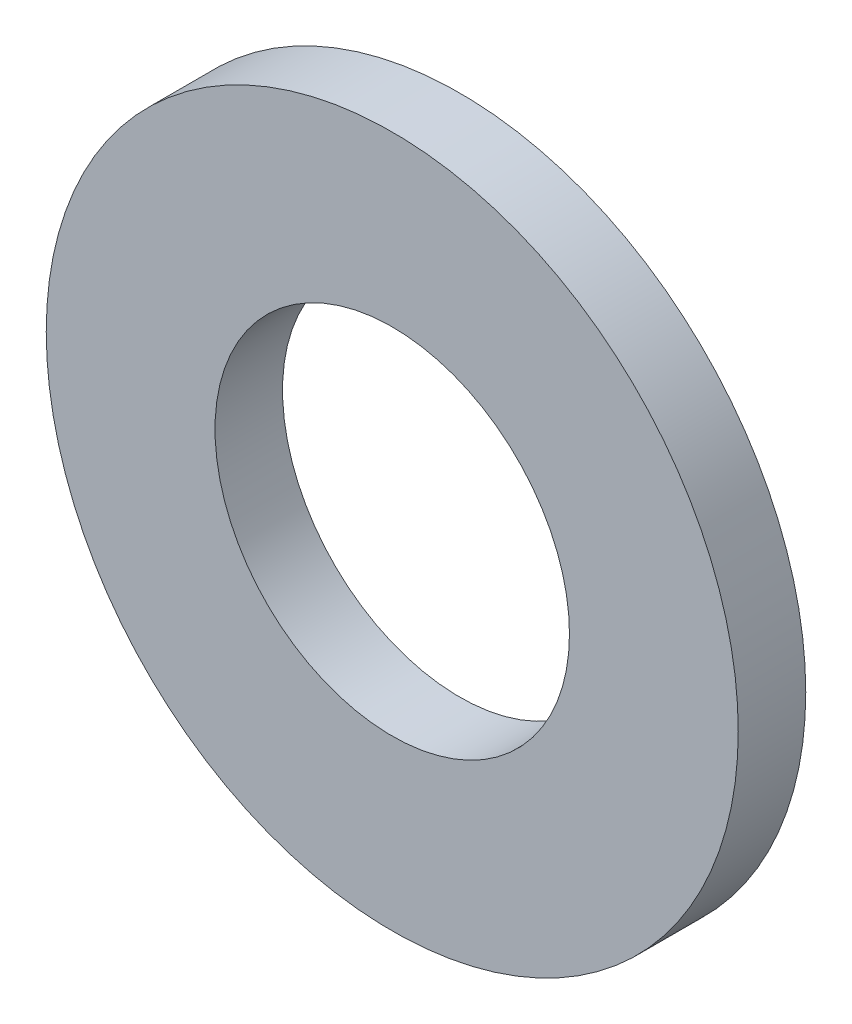
ISO-10303-21;
HEADER;
FILE_DESCRIPTION(('STEP AP214'),'2;1');
FILE_NAME('part.step','',(''),(''),'','','');
FILE_SCHEMA(('AUTOMOTIVE_DESIGN { 1 0 10303 214 1 1 1 1 }'));
ENDSEC;
DATA;
#1=APPLICATION_CONTEXT('core data for automotive mechanical design processes');
#2=APPLICATION_PROTOCOL_DEFINITION('international standard','automotive_design',2000,#1);
#3=PRODUCT_CONTEXT('',#1,'mechanical');
#4=PRODUCT('Part','Part','',(#3));
#5=PRODUCT_RELATED_PRODUCT_CATEGORY('part','',(#4));
#6=PRODUCT_DEFINITION_FORMATION('','',#4);
#7=PRODUCT_DEFINITION_CONTEXT('part definition',#1,'design');
#8=PRODUCT_DEFINITION('design','',#6,#7);
#9=PRODUCT_DEFINITION_SHAPE('','',#8);
#10=(LENGTH_UNIT() NAMED_UNIT(*) SI_UNIT(.MILLI.,.METRE.));
#11=(NAMED_UNIT(*) PLANE_ANGLE_UNIT() SI_UNIT($,.RADIAN.));
#12=(NAMED_UNIT(*) SI_UNIT($,.STERADIAN.) SOLID_ANGLE_UNIT());
#13=UNCERTAINTY_MEASURE_WITH_UNIT(LENGTH_MEASURE(1.E-05),#10,'distance_accuracy_value','');
#14=(GEOMETRIC_REPRESENTATION_CONTEXT(3) GLOBAL_UNCERTAINTY_ASSIGNED_CONTEXT((#13)) GLOBAL_UNIT_ASSIGNED_CONTEXT((#10,
#11,#12)) REPRESENTATION_CONTEXT('',''));
#15=CARTESIAN_POINT('',(0.,0.,0.));
#16=DIRECTION('',(0.,0.,1.));
#17=DIRECTION('',(1.,0.,0.));
#18=AXIS2_PLACEMENT_3D('',#15,#16,#17);
#19=CARTESIAN_POINT('',(0.,0.,1.2));
#20=DIRECTION('',(0.,0.,1.));
#21=DIRECTION('',(1.,0.,0.));
#22=AXIS2_PLACEMENT_3D('',#19,#20,#21);
#23=PLANE('',#22);
#24=CARTESIAN_POINT('',(0.,0.,1.2));
#25=DIRECTION('',(0.,0.,1.));
#26=DIRECTION('',(1.,0.,0.));
#27=AXIS2_PLACEMENT_3D('',#24,#25,#26);
#28=CIRCLE('',#27,6.15);
#29=CARTESIAN_POINT('',(6.15,0.,1.2));
#30=VERTEX_POINT('',#29);
#31=EDGE_CURVE('E10',#30,#30,#28,.T.);
#32=ORIENTED_EDGE('',*,*,#31,.T.);
#33=EDGE_LOOP('',(#32));
#34=FACE_BOUND('',#33,.T.);
#35=CARTESIAN_POINT('',(0.,0.,1.2));
#36=DIRECTION('',(0.,0.,1.));
#37=DIRECTION('',(1.,0.,0.));
#38=AXIS2_PLACEMENT_3D('',#35,#36,#37);
#39=CIRCLE('',#38,3.15);
#40=CARTESIAN_POINT('',(3.15,0.,1.2));
#41=VERTEX_POINT('',#40);
#42=EDGE_CURVE('E50',#41,#41,#39,.T.);
#43=ORIENTED_EDGE('',*,*,#42,.F.);
#44=EDGE_LOOP('',(#43));
#45=FACE_BOUND('',#44,.T.);
#46=ADVANCED_FACE('F37',(#34,#45),#23,.T.);
#47=CARTESIAN_POINT('',(0.,0.,0.));
#48=DIRECTION('',(0.,0.,1.));
#49=DIRECTION('',(1.,0.,0.));
#50=AXIS2_PLACEMENT_3D('',#47,#48,#49);
#51=PLANE('',#50);
#52=CARTESIAN_POINT('',(0.,0.,0.));
#53=DIRECTION('',(0.,0.,1.));
#54=DIRECTION('',(1.,0.,0.));
#55=AXIS2_PLACEMENT_3D('',#52,#53,#54);
#56=CIRCLE('',#55,6.15);
#57=CARTESIAN_POINT('',(6.15,0.,0.));
#58=VERTEX_POINT('',#57);
#59=EDGE_CURVE('E41',#58,#58,#56,.T.);
#60=ORIENTED_EDGE('',*,*,#59,.F.);
#61=EDGE_LOOP('',(#60));
#62=FACE_BOUND('',#61,.T.);
#63=CARTESIAN_POINT('',(0.,0.,0.));
#64=DIRECTION('',(0.,0.,1.));
#65=DIRECTION('',(1.,0.,0.));
#66=AXIS2_PLACEMENT_3D('',#63,#64,#65);
#67=CIRCLE('',#66,3.15);
#68=CARTESIAN_POINT('',(3.15,0.,0.));
#69=VERTEX_POINT('',#68);
#70=EDGE_CURVE('E52',#69,#69,#67,.T.);
#71=ORIENTED_EDGE('',*,*,#70,.T.);
#72=EDGE_LOOP('',(#71));
#73=FACE_BOUND('',#72,.T.);
#74=ADVANCED_FACE('F64',(#62,#73),#51,.F.);
#75=CARTESIAN_POINT('',(0.,0.,1.2));
#76=DIRECTION('',(0.,0.,-1.));
#77=DIRECTION('',(-1.,0.,0.));
#78=AXIS2_PLACEMENT_3D('',#75,#76,#77);
#79=CYLINDRICAL_SURFACE('',#78,6.15);
#80=ORIENTED_EDGE('',*,*,#31,.F.);
#81=EDGE_LOOP('',(#80));
#82=FACE_BOUND('',#81,.T.);
#83=ORIENTED_EDGE('',*,*,#59,.T.);
#84=EDGE_LOOP('',(#83));
#85=FACE_BOUND('',#84,.T.);
#86=ADVANCED_FACE('F39',(#82,#85),#79,.T.);
#87=CARTESIAN_POINT('',(0.,0.,1.2));
#88=DIRECTION('',(0.,0.,-1.));
#89=DIRECTION('',(-1.,0.,0.));
#90=AXIS2_PLACEMENT_3D('',#87,#88,#89);
#91=CYLINDRICAL_SURFACE('',#90,3.15);
#92=ORIENTED_EDGE('',*,*,#42,.T.);
#93=EDGE_LOOP('',(#92));
#94=FACE_BOUND('',#93,.T.);
#95=ORIENTED_EDGE('',*,*,#70,.F.);
#96=EDGE_LOOP('',(#95));
#97=FACE_BOUND('',#96,.T.);
#98=ADVANCED_FACE('F60',(#94,#97),#91,.F.);
#99=CLOSED_SHELL('',(#46,#74,#86,#98));
#100=MANIFOLD_SOLID_BREP('B2',#99);
#101=ADVANCED_BREP_SHAPE_REPRESENTATION('',(#18,#100),#14);
#102=SHAPE_DEFINITION_REPRESENTATION(#9,#101);
ENDSEC;
END-ISO-10303-21;
